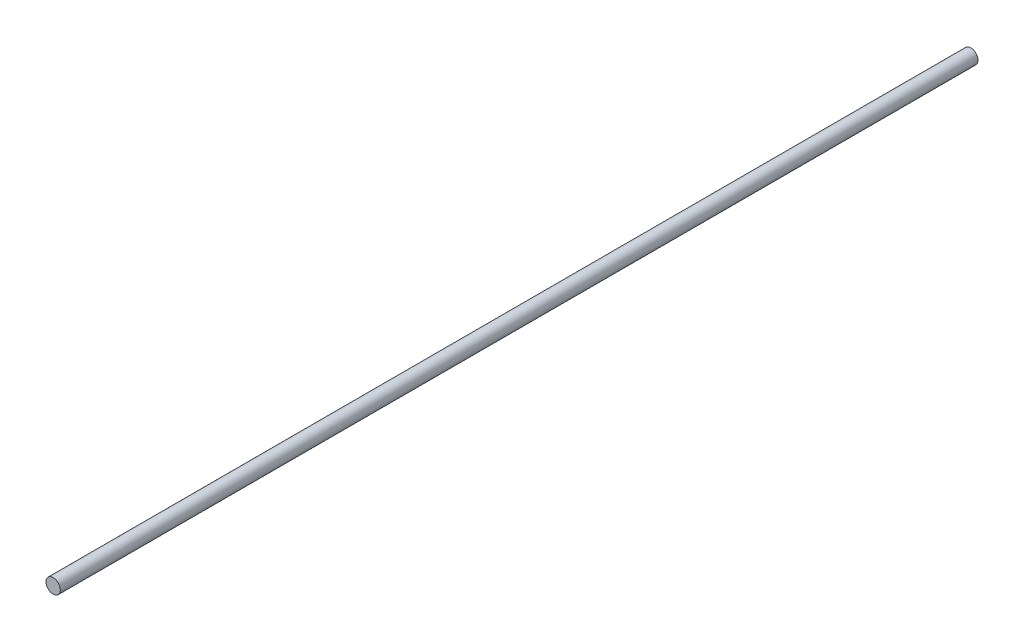
ISO-10303-21;
HEADER;
FILE_DESCRIPTION(('STEP AP214'),'2;1');
FILE_NAME('part.step','',(''),(''),'','','');
FILE_SCHEMA(('AUTOMOTIVE_DESIGN { 1 0 10303 214 1 1 1 1 }'));
ENDSEC;
DATA;
#1=APPLICATION_CONTEXT('core data for automotive mechanical design processes');
#2=APPLICATION_PROTOCOL_DEFINITION('international standard','automotive_design',2000,#1);
#3=PRODUCT_CONTEXT('',#1,'mechanical');
#4=PRODUCT('Part','Part','',(#3));
#5=PRODUCT_RELATED_PRODUCT_CATEGORY('part','',(#4));
#6=PRODUCT_DEFINITION_FORMATION('','',#4);
#7=PRODUCT_DEFINITION_CONTEXT('part definition',#1,'design');
#8=PRODUCT_DEFINITION('design','',#6,#7);
#9=PRODUCT_DEFINITION_SHAPE('','',#8);
#10=(LENGTH_UNIT() NAMED_UNIT(*) SI_UNIT(.MILLI.,.METRE.));
#11=(NAMED_UNIT(*) PLANE_ANGLE_UNIT() SI_UNIT($,.RADIAN.));
#12=(NAMED_UNIT(*) SI_UNIT($,.STERADIAN.) SOLID_ANGLE_UNIT());
#13=UNCERTAINTY_MEASURE_WITH_UNIT(LENGTH_MEASURE(1.E-05),#10,'distance_accuracy_value','');
#14=(GEOMETRIC_REPRESENTATION_CONTEXT(3) GLOBAL_UNCERTAINTY_ASSIGNED_CONTEXT((#13)) GLOBAL_UNIT_ASSIGNED_CONTEXT((#10,
#11,#12)) REPRESENTATION_CONTEXT('',''));
#15=CARTESIAN_POINT('',(0.,0.,0.));
#16=DIRECTION('',(0.,0.,1.));
#17=DIRECTION('',(1.,0.,0.));
#18=AXIS2_PLACEMENT_3D('',#15,#16,#17);
#19=CARTESIAN_POINT('',(0.,0.,406.4));
#20=DIRECTION('',(0.,0.,-1.));
#21=DIRECTION('',(-1.,0.,0.));
#22=AXIS2_PLACEMENT_3D('',#19,#20,#21);
#23=CYLINDRICAL_SURFACE('',#22,3.175);
#24=CARTESIAN_POINT('',(0.,0.,406.4));
#25=DIRECTION('',(0.,0.,1.));
#26=DIRECTION('',(1.,0.,0.));
#27=AXIS2_PLACEMENT_3D('',#24,#25,#26);
#28=CIRCLE('',#27,3.175);
#29=CARTESIAN_POINT('',(3.175,0.,406.4));
#30=VERTEX_POINT('',#29);
#31=EDGE_CURVE('E10',#30,#30,#28,.T.);
#32=ORIENTED_EDGE('',*,*,#31,.F.);
#33=EDGE_LOOP('',(#32));
#34=FACE_BOUND('',#33,.T.);
#35=CARTESIAN_POINT('',(0.,0.,0.));
#36=DIRECTION('',(0.,0.,1.));
#37=DIRECTION('',(1.,0.,0.));
#38=AXIS2_PLACEMENT_3D('',#35,#36,#37);
#39=CIRCLE('',#38,3.175);
#40=CARTESIAN_POINT('',(3.175,0.,0.));
#41=VERTEX_POINT('',#40);
#42=EDGE_CURVE('E38',#41,#41,#39,.T.);
#43=ORIENTED_EDGE('',*,*,#42,.T.);
#44=EDGE_LOOP('',(#43));
#45=FACE_BOUND('',#44,.T.);
#46=ADVANCED_FACE('F35',(#34,#45),#23,.T.);
#47=CARTESIAN_POINT('',(0.,0.,406.4));
#48=DIRECTION('',(0.,0.,1.));
#49=DIRECTION('',(1.,0.,0.));
#50=AXIS2_PLACEMENT_3D('',#47,#48,#49);
#51=PLANE('',#50);
#52=ORIENTED_EDGE('',*,*,#31,.T.);
#53=EDGE_LOOP('',(#52));
#54=FACE_BOUND('',#53,.T.);
#55=ADVANCED_FACE('F50',(#54),#51,.T.);
#56=CARTESIAN_POINT('',(0.,0.,0.));
#57=DIRECTION('',(0.,0.,1.));
#58=DIRECTION('',(1.,0.,0.));
#59=AXIS2_PLACEMENT_3D('',#56,#57,#58);
#60=PLANE('',#59);
#61=ORIENTED_EDGE('',*,*,#42,.F.);
#62=EDGE_LOOP('',(#61));
#63=FACE_BOUND('',#62,.T.);
#64=ADVANCED_FACE('F48',(#63),#60,.F.);
#65=CLOSED_SHELL('',(#46,#55,#64));
#66=MANIFOLD_SOLID_BREP('B2',#65);
#67=ADVANCED_BREP_SHAPE_REPRESENTATION('',(#18,#66),#14);
#68=SHAPE_DEFINITION_REPRESENTATION(#9,#67);
ENDSEC;
END-ISO-10303-21;
